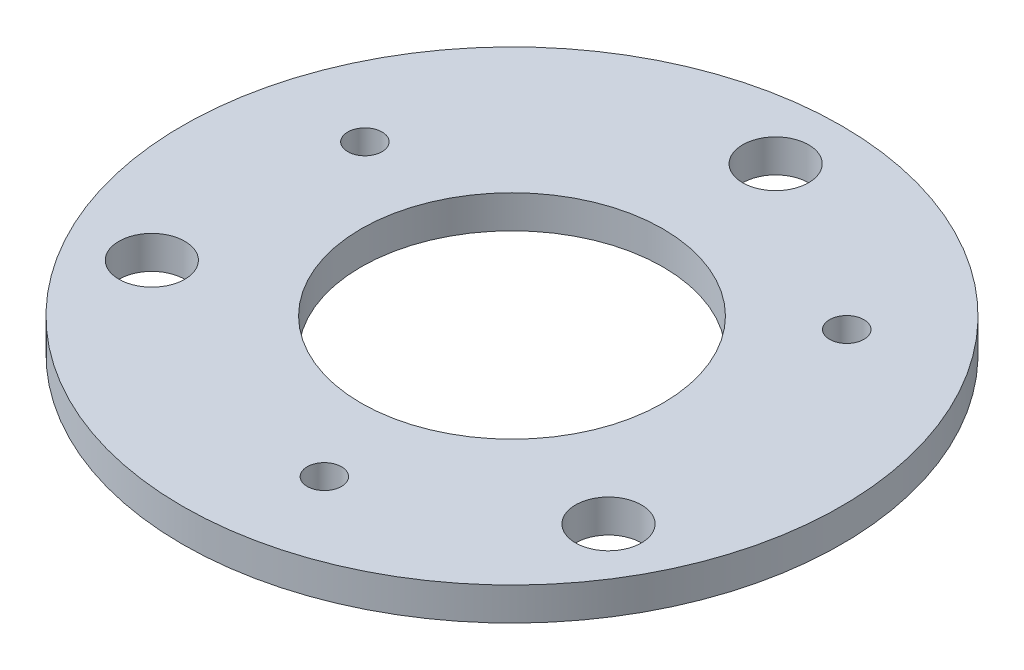
ISO-10303-21;
HEADER;
FILE_DESCRIPTION(('STEP AP214'),'2;1');
FILE_NAME('part.step','',(''),(''),'','','');
FILE_SCHEMA(('AUTOMOTIVE_DESIGN { 1 0 10303 214 1 1 1 1 }'));
ENDSEC;
DATA;
#1=APPLICATION_CONTEXT('core data for automotive mechanical design processes');
#2=APPLICATION_PROTOCOL_DEFINITION('international standard','automotive_design',2000,#1);
#3=PRODUCT_CONTEXT('',#1,'mechanical');
#4=PRODUCT('Part','Part','',(#3));
#5=PRODUCT_RELATED_PRODUCT_CATEGORY('part','',(#4));
#6=PRODUCT_DEFINITION_FORMATION('','',#4);
#7=PRODUCT_DEFINITION_CONTEXT('part definition',#1,'design');
#8=PRODUCT_DEFINITION('design','',#6,#7);
#9=PRODUCT_DEFINITION_SHAPE('','',#8);
#10=(LENGTH_UNIT() NAMED_UNIT(*) SI_UNIT(.MILLI.,.METRE.));
#11=(NAMED_UNIT(*) PLANE_ANGLE_UNIT() SI_UNIT($,.RADIAN.));
#12=(NAMED_UNIT(*) SI_UNIT($,.STERADIAN.) SOLID_ANGLE_UNIT());
#13=UNCERTAINTY_MEASURE_WITH_UNIT(LENGTH_MEASURE(1.E-05),#10,'distance_accuracy_value','');
#14=(GEOMETRIC_REPRESENTATION_CONTEXT(3) GLOBAL_UNCERTAINTY_ASSIGNED_CONTEXT((#13)) GLOBAL_UNIT_ASSIGNED_CONTEXT((#10,
#11,#12)) REPRESENTATION_CONTEXT('',''));
#15=CARTESIAN_POINT('',(0.,0.,0.));
#16=DIRECTION('',(0.,0.,1.));
#17=DIRECTION('',(1.,0.,0.));
#18=AXIS2_PLACEMENT_3D('',#15,#16,#17);
#19=CARTESIAN_POINT('',(0.,6.35,0.));
#20=DIRECTION('',(0.,1.,0.));
#21=DIRECTION('',(0.,0.,1.));
#22=AXIS2_PLACEMENT_3D('',#19,#20,#21);
#23=PLANE('',#22);
#24=CARTESIAN_POINT('',(8.72378726861535,6.35,44.8799948272273));
#25=DIRECTION('',(0.,1.,0.));
#26=DIRECTION('',(0.866025403784443,0.,-0.499999999999992));
#27=AXIS2_PLACEMENT_3D('',#24,#25,#26);
#28=CIRCLE('',#27,3.30200000000001);
#29=CARTESIAN_POINT('',(11.5834031519116,6.35,43.2289948272273));
#30=VERTEX_POINT('',#29);
#31=EDGE_CURVE('E80',#30,#30,#28,.T.);
#32=ORIENTED_EDGE('',*,*,#31,.F.);
#33=EDGE_LOOP('',(#32));
#34=FACE_BOUND('',#33,.T.);
#35=CARTESIAN_POINT('',(34.5053220077852,6.35,-29.9950188054459));
#36=DIRECTION('',(0.,1.,0.));
#37=DIRECTION('',(-0.866025403784436,0.,-0.500000000000004));
#38=AXIS2_PLACEMENT_3D('',#35,#36,#37);
#39=CIRCLE('',#38,3.30200000000001);
#40=CARTESIAN_POINT('',(31.645706124489,6.35,-31.646018805446));
#41=VERTEX_POINT('',#40);
#42=EDGE_CURVE('E74',#41,#41,#39,.T.);
#43=ORIENTED_EDGE('',*,*,#42,.F.);
#44=EDGE_LOOP('',(#43));
#45=FACE_BOUND('',#44,.T.);
#46=CARTESIAN_POINT('',(-43.2291092764008,6.35,-14.8849760217811));
#47=DIRECTION('',(0.,1.,0.));
#48=DIRECTION('',(0.,0.,1.));
#49=AXIS2_PLACEMENT_3D('',#46,#47,#48);
#50=CIRCLE('',#49,3.30200000000001);
#51=CARTESIAN_POINT('',(-43.2291092764008,6.35,-11.5829760217811));
#52=VERTEX_POINT('',#51);
#53=EDGE_CURVE('E68',#52,#52,#50,.T.);
#54=ORIENTED_EDGE('',*,*,#53,.F.);
#55=EDGE_LOOP('',(#54));
#56=FACE_BOUND('',#55,.T.);
#57=CARTESIAN_POINT('',(43.9940905122527,6.35,25.3999999999981));
#58=DIRECTION('',(0.,1.,0.));
#59=DIRECTION('',(0.,0.,1.));
#60=AXIS2_PLACEMENT_3D('',#57,#58,#59);
#61=CIRCLE('',#60,6.35000000000278);
#62=CARTESIAN_POINT('',(43.9940905122527,6.35,31.7500000000009));
#63=VERTEX_POINT('',#62);
#64=EDGE_CURVE('E53',#63,#63,#61,.T.);
#65=ORIENTED_EDGE('',*,*,#64,.F.);
#66=EDGE_LOOP('',(#65));
#67=FACE_BOUND('',#66,.T.);
#68=CARTESIAN_POINT('',(0.,6.35,0.));
#69=DIRECTION('',(0.,1.,0.));
#70=DIRECTION('',(0.,0.,1.));
#71=AXIS2_PLACEMENT_3D('',#68,#69,#70);
#72=CIRCLE('',#71,29.083);
#73=CARTESIAN_POINT('',(0.,6.35,29.083));
#74=VERTEX_POINT('',#73);
#75=EDGE_CURVE('E42',#74,#74,#72,.T.);
#76=ORIENTED_EDGE('',*,*,#75,.F.);
#77=EDGE_LOOP('',(#76));
#78=FACE_BOUND('',#77,.T.);
#79=CARTESIAN_POINT('',(0.,6.35,0.));
#80=DIRECTION('',(0.,1.,0.));
#81=DIRECTION('',(0.,0.,1.));
#82=AXIS2_PLACEMENT_3D('',#79,#80,#81);
#83=CIRCLE('',#82,63.5);
#84=CARTESIAN_POINT('',(0.,6.35,63.5));
#85=VERTEX_POINT('',#84);
#86=EDGE_CURVE('E10',#85,#85,#83,.T.);
#87=ORIENTED_EDGE('',*,*,#86,.T.);
#88=EDGE_LOOP('',(#87));
#89=FACE_BOUND('',#88,.T.);
#90=CARTESIAN_POINT('',(0.,6.35,-50.8));
#91=DIRECTION('',(0.,1.,0.));
#92=DIRECTION('',(0.,0.,1.));
#93=AXIS2_PLACEMENT_3D('',#90,#91,#92);
#94=CIRCLE('',#93,6.35);
#95=CARTESIAN_POINT('',(0.,6.35,-44.45));
#96=VERTEX_POINT('',#95);
#97=EDGE_CURVE('E47',#96,#96,#94,.T.);
#98=ORIENTED_EDGE('',*,*,#97,.F.);
#99=EDGE_LOOP('',(#98));
#100=FACE_BOUND('',#99,.T.);
#101=CARTESIAN_POINT('',(-43.9940905122462,6.35,25.4000000000019));
#102=DIRECTION('',(0.,1.,0.));
#103=DIRECTION('',(0.,0.,1.));
#104=AXIS2_PLACEMENT_3D('',#101,#102,#103);
#105=CIRCLE('',#104,6.35000000000412);
#106=CARTESIAN_POINT('',(-43.9940905122462,6.35,31.750000000006));
#107=VERTEX_POINT('',#106);
#108=EDGE_CURVE('E59',#107,#107,#105,.T.);
#109=ORIENTED_EDGE('',*,*,#108,.F.);
#110=EDGE_LOOP('',(#109));
#111=FACE_BOUND('',#110,.T.);
#112=ADVANCED_FACE('F31',(#34,#45,#56,#67,#78,#89,#100,#111),#23,.T.);
#113=CARTESIAN_POINT('',(0.,0.,0.));
#114=DIRECTION('',(0.,1.,0.));
#115=DIRECTION('',(0.,0.,1.));
#116=AXIS2_PLACEMENT_3D('',#113,#114,#115);
#117=PLANE('',#116);
#118=CARTESIAN_POINT('',(8.72378726861535,0.,44.8799948272273));
#119=DIRECTION('',(0.,1.,0.));
#120=DIRECTION('',(0.866025403784443,0.,-0.499999999999992));
#121=AXIS2_PLACEMENT_3D('',#118,#119,#120);
#122=CIRCLE('',#121,3.30200000000001);
#123=CARTESIAN_POINT('',(11.5834031519116,0.,43.2289948272273));
#124=VERTEX_POINT('',#123);
#125=EDGE_CURVE('E77',#124,#124,#122,.T.);
#126=ORIENTED_EDGE('',*,*,#125,.T.);
#127=EDGE_LOOP('',(#126));
#128=FACE_BOUND('',#127,.T.);
#129=CARTESIAN_POINT('',(34.5053220077852,0.,-29.9950188054459));
#130=DIRECTION('',(0.,1.,0.));
#131=DIRECTION('',(-0.866025403784436,0.,-0.500000000000004));
#132=AXIS2_PLACEMENT_3D('',#129,#130,#131);
#133=CIRCLE('',#132,3.30200000000001);
#134=CARTESIAN_POINT('',(31.645706124489,0.,-31.646018805446));
#135=VERTEX_POINT('',#134);
#136=EDGE_CURVE('E71',#135,#135,#133,.T.);
#137=ORIENTED_EDGE('',*,*,#136,.T.);
#138=EDGE_LOOP('',(#137));
#139=FACE_BOUND('',#138,.T.);
#140=CARTESIAN_POINT('',(-43.2291092764008,0.,-14.8849760217811));
#141=DIRECTION('',(0.,1.,0.));
#142=DIRECTION('',(0.,0.,1.));
#143=AXIS2_PLACEMENT_3D('',#140,#141,#142);
#144=CIRCLE('',#143,3.30200000000001);
#145=CARTESIAN_POINT('',(-43.2291092764008,0.,-11.5829760217811));
#146=VERTEX_POINT('',#145);
#147=EDGE_CURVE('E65',#146,#146,#144,.T.);
#148=ORIENTED_EDGE('',*,*,#147,.T.);
#149=EDGE_LOOP('',(#148));
#150=FACE_BOUND('',#149,.T.);
#151=CARTESIAN_POINT('',(0.,0.,0.));
#152=DIRECTION('',(0.,1.,0.));
#153=DIRECTION('',(0.,0.,1.));
#154=AXIS2_PLACEMENT_3D('',#151,#152,#153);
#155=CIRCLE('',#154,63.5);
#156=CARTESIAN_POINT('',(0.,0.,63.5));
#157=VERTEX_POINT('',#156);
#158=EDGE_CURVE('E35',#157,#157,#155,.T.);
#159=ORIENTED_EDGE('',*,*,#158,.F.);
#160=EDGE_LOOP('',(#159));
#161=FACE_BOUND('',#160,.T.);
#162=CARTESIAN_POINT('',(0.,0.,0.));
#163=DIRECTION('',(0.,1.,0.));
#164=DIRECTION('',(0.,0.,1.));
#165=AXIS2_PLACEMENT_3D('',#162,#163,#164);
#166=CIRCLE('',#165,29.083);
#167=CARTESIAN_POINT('',(0.,0.,29.083));
#168=VERTEX_POINT('',#167);
#169=EDGE_CURVE('E44',#168,#168,#166,.T.);
#170=ORIENTED_EDGE('',*,*,#169,.T.);
#171=EDGE_LOOP('',(#170));
#172=FACE_BOUND('',#171,.T.);
#173=CARTESIAN_POINT('',(0.,0.,-50.8));
#174=DIRECTION('',(0.,1.,0.));
#175=DIRECTION('',(0.,0.,1.));
#176=AXIS2_PLACEMENT_3D('',#173,#174,#175);
#177=CIRCLE('',#176,6.35);
#178=CARTESIAN_POINT('',(0.,0.,-44.45));
#179=VERTEX_POINT('',#178);
#180=EDGE_CURVE('E50',#179,#179,#177,.T.);
#181=ORIENTED_EDGE('',*,*,#180,.T.);
#182=EDGE_LOOP('',(#181));
#183=FACE_BOUND('',#182,.T.);
#184=CARTESIAN_POINT('',(43.9940905122527,0.,25.3999999999981));
#185=DIRECTION('',(0.,1.,0.));
#186=DIRECTION('',(0.,0.,1.));
#187=AXIS2_PLACEMENT_3D('',#184,#185,#186);
#188=CIRCLE('',#187,6.35000000000278);
#189=CARTESIAN_POINT('',(43.9940905122527,0.,31.7500000000009));
#190=VERTEX_POINT('',#189);
#191=EDGE_CURVE('E56',#190,#190,#188,.T.);
#192=ORIENTED_EDGE('',*,*,#191,.T.);
#193=EDGE_LOOP('',(#192));
#194=FACE_BOUND('',#193,.T.);
#195=CARTESIAN_POINT('',(-43.9940905122462,0.,25.4000000000019));
#196=DIRECTION('',(0.,1.,0.));
#197=DIRECTION('',(0.,0.,1.));
#198=AXIS2_PLACEMENT_3D('',#195,#196,#197);
#199=CIRCLE('',#198,6.35000000000412);
#200=CARTESIAN_POINT('',(-43.9940905122462,0.,31.750000000006));
#201=VERTEX_POINT('',#200);
#202=EDGE_CURVE('E62',#201,#201,#199,.T.);
#203=ORIENTED_EDGE('',*,*,#202,.T.);
#204=EDGE_LOOP('',(#203));
#205=FACE_BOUND('',#204,.T.);
#206=ADVANCED_FACE('F86',(#128,#139,#150,#161,#172,#183,#194,#205),#117,.F.);
#207=CARTESIAN_POINT('',(0.,6.35,0.));
#208=DIRECTION('',(0.,-1.,0.));
#209=DIRECTION('',(0.,0.,-1.));
#210=AXIS2_PLACEMENT_3D('',#207,#208,#209);
#211=CYLINDRICAL_SURFACE('',#210,63.5);
#212=ORIENTED_EDGE('',*,*,#86,.F.);
#213=EDGE_LOOP('',(#212));
#214=FACE_BOUND('',#213,.T.);
#215=ORIENTED_EDGE('',*,*,#158,.T.);
#216=EDGE_LOOP('',(#215));
#217=FACE_BOUND('',#216,.T.);
#218=ADVANCED_FACE('F33',(#214,#217),#211,.T.);
#219=CARTESIAN_POINT('',(0.,6.35,0.));
#220=DIRECTION('',(0.,-1.,0.));
#221=DIRECTION('',(0.,0.,-1.));
#222=AXIS2_PLACEMENT_3D('',#219,#220,#221);
#223=CYLINDRICAL_SURFACE('',#222,29.083);
#224=ORIENTED_EDGE('',*,*,#75,.T.);
#225=EDGE_LOOP('',(#224));
#226=FACE_BOUND('',#225,.T.);
#227=ORIENTED_EDGE('',*,*,#169,.F.);
#228=EDGE_LOOP('',(#227));
#229=FACE_BOUND('',#228,.T.);
#230=ADVANCED_FACE('F123',(#226,#229),#223,.F.);
#231=CARTESIAN_POINT('',(0.,6.35,-50.8));
#232=DIRECTION('',(0.,-1.,0.));
#233=DIRECTION('',(0.,0.,-1.));
#234=AXIS2_PLACEMENT_3D('',#231,#232,#233);
#235=CYLINDRICAL_SURFACE('',#234,6.35);
#236=ORIENTED_EDGE('',*,*,#97,.T.);
#237=EDGE_LOOP('',(#236));
#238=FACE_BOUND('',#237,.T.);
#239=ORIENTED_EDGE('',*,*,#180,.F.);
#240=EDGE_LOOP('',(#239));
#241=FACE_BOUND('',#240,.T.);
#242=ADVANCED_FACE('F128',(#238,#241),#235,.F.);
#243=CARTESIAN_POINT('',(43.9940905122527,6.35,25.3999999999981));
#244=DIRECTION('',(0.,-1.,0.));
#245=DIRECTION('',(0.,0.,-1.));
#246=AXIS2_PLACEMENT_3D('',#243,#244,#245);
#247=CYLINDRICAL_SURFACE('',#246,6.35000000000278);
#248=ORIENTED_EDGE('',*,*,#64,.T.);
#249=EDGE_LOOP('',(#248));
#250=FACE_BOUND('',#249,.T.);
#251=ORIENTED_EDGE('',*,*,#191,.F.);
#252=EDGE_LOOP('',(#251));
#253=FACE_BOUND('',#252,.T.);
#254=ADVANCED_FACE('F115',(#250,#253),#247,.F.);
#255=CARTESIAN_POINT('',(-43.9940905122462,6.35,25.4000000000019));
#256=DIRECTION('',(0.,-1.,0.));
#257=DIRECTION('',(0.,0.,-1.));
#258=AXIS2_PLACEMENT_3D('',#255,#256,#257);
#259=CYLINDRICAL_SURFACE('',#258,6.35000000000412);
#260=ORIENTED_EDGE('',*,*,#108,.T.);
#261=EDGE_LOOP('',(#260));
#262=FACE_BOUND('',#261,.T.);
#263=ORIENTED_EDGE('',*,*,#202,.F.);
#264=EDGE_LOOP('',(#263));
#265=FACE_BOUND('',#264,.T.);
#266=ADVANCED_FACE('F111',(#262,#265),#259,.F.);
#267=CARTESIAN_POINT('',(-43.2291092764008,0.,-14.8849760217811));
#268=DIRECTION('',(0.,1.,0.));
#269=DIRECTION('',(0.,0.,1.));
#270=AXIS2_PLACEMENT_3D('',#267,#268,#269);
#271=CYLINDRICAL_SURFACE('',#270,3.30200000000001);
#272=ORIENTED_EDGE('',*,*,#147,.F.);
#273=EDGE_LOOP('',(#272));
#274=FACE_BOUND('',#273,.T.);
#275=ORIENTED_EDGE('',*,*,#53,.T.);
#276=EDGE_LOOP('',(#275));
#277=FACE_BOUND('',#276,.T.);
#278=ADVANCED_FACE('F114',(#274,#277),#271,.F.);
#279=CARTESIAN_POINT('',(34.5053220077852,0.,-29.9950188054459));
#280=DIRECTION('',(0.,1.,0.));
#281=DIRECTION('',(0.,0.,1.));
#282=AXIS2_PLACEMENT_3D('',#279,#280,#281);
#283=CYLINDRICAL_SURFACE('',#282,3.30200000000001);
#284=ORIENTED_EDGE('',*,*,#136,.F.);
#285=EDGE_LOOP('',(#284));
#286=FACE_BOUND('',#285,.T.);
#287=ORIENTED_EDGE('',*,*,#42,.T.);
#288=EDGE_LOOP('',(#287));
#289=FACE_BOUND('',#288,.T.);
#290=ADVANCED_FACE('F92',(#286,#289),#283,.F.);
#291=CARTESIAN_POINT('',(8.72378726861535,0.,44.8799948272273));
#292=DIRECTION('',(0.,1.,0.));
#293=DIRECTION('',(0.,0.,1.));
#294=AXIS2_PLACEMENT_3D('',#291,#292,#293);
#295=CYLINDRICAL_SURFACE('',#294,3.30200000000001);
#296=ORIENTED_EDGE('',*,*,#125,.F.);
#297=EDGE_LOOP('',(#296));
#298=FACE_BOUND('',#297,.T.);
#299=ORIENTED_EDGE('',*,*,#31,.T.);
#300=EDGE_LOOP('',(#299));
#301=FACE_BOUND('',#300,.T.);
#302=ADVANCED_FACE('F89',(#298,#301),#295,.F.);
#303=CLOSED_SHELL('',(#112,#206,#218,#230,#242,#254,#266,#278,#290,#302));
#304=MANIFOLD_SOLID_BREP('B2',#303);
#305=ADVANCED_BREP_SHAPE_REPRESENTATION('',(#18,#304),#14);
#306=SHAPE_DEFINITION_REPRESENTATION(#9,#305);
ENDSEC;
END-ISO-10303-21;
